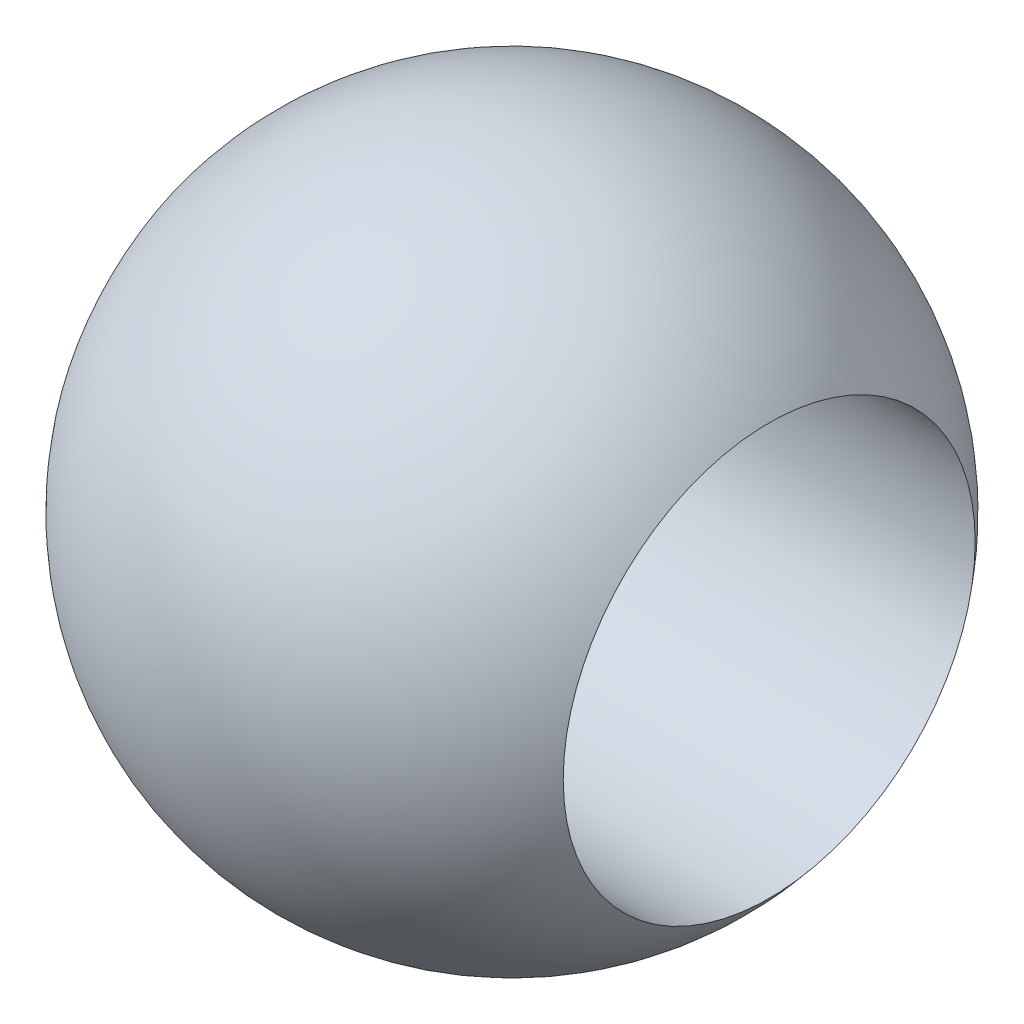
ISO-10303-21;
HEADER;
FILE_DESCRIPTION(('STEP AP214'),'2;1');
FILE_NAME('part.step','',(''),(''),'','','');
FILE_SCHEMA(('AUTOMOTIVE_DESIGN { 1 0 10303 214 1 1 1 1 }'));
ENDSEC;
DATA;
#1=APPLICATION_CONTEXT('core data for automotive mechanical design processes');
#2=APPLICATION_PROTOCOL_DEFINITION('international standard','automotive_design',2000,#1);
#3=PRODUCT_CONTEXT('',#1,'mechanical');
#4=PRODUCT('Part','Part','',(#3));
#5=PRODUCT_RELATED_PRODUCT_CATEGORY('part','',(#4));
#6=PRODUCT_DEFINITION_FORMATION('','',#4);
#7=PRODUCT_DEFINITION_CONTEXT('part definition',#1,'design');
#8=PRODUCT_DEFINITION('design','',#6,#7);
#9=PRODUCT_DEFINITION_SHAPE('','',#8);
#10=(LENGTH_UNIT() NAMED_UNIT(*) SI_UNIT(.MILLI.,.METRE.));
#11=(NAMED_UNIT(*) PLANE_ANGLE_UNIT() SI_UNIT($,.RADIAN.));
#12=(NAMED_UNIT(*) SI_UNIT($,.STERADIAN.) SOLID_ANGLE_UNIT());
#13=UNCERTAINTY_MEASURE_WITH_UNIT(LENGTH_MEASURE(1.E-05),#10,'distance_accuracy_value','');
#14=(GEOMETRIC_REPRESENTATION_CONTEXT(3) GLOBAL_UNCERTAINTY_ASSIGNED_CONTEXT((#13)) GLOBAL_UNIT_ASSIGNED_CONTEXT((#10,
#11,#12)) REPRESENTATION_CONTEXT('',''));
#15=CARTESIAN_POINT('',(0.,0.,0.));
#16=DIRECTION('',(0.,0.,1.));
#17=DIRECTION('',(1.,0.,0.));
#18=AXIS2_PLACEMENT_3D('',#15,#16,#17);
#19=CARTESIAN_POINT('',(0.,0.,0.));
#20=DIRECTION('',(1.,0.,0.));
#21=DIRECTION('',(0.,1.,0.));
#22=AXIS2_PLACEMENT_3D('',#19,#20,#21);
#23=SPHERICAL_SURFACE('',#22,8.128);
#24=CARTESIAN_POINT('',(-6.34491796637277,0.,0.));
#25=DIRECTION('',(1.,0.,0.));
#26=DIRECTION('',(0.,0.,-1.));
#27=AXIS2_PLACEMENT_3D('',#24,#25,#26);
#28=CIRCLE('',#27,5.08);
#29=CARTESIAN_POINT('',(-6.34491796637277,0.,-5.08));
#30=VERTEX_POINT('',#29);
#31=EDGE_CURVE('E10',#30,#30,#28,.T.);
#32=ORIENTED_EDGE('',*,*,#31,.T.);
#33=EDGE_LOOP('',(#32));
#34=FACE_BOUND('',#33,.T.);
#35=CARTESIAN_POINT('',(6.34491796637277,0.,0.));
#36=DIRECTION('',(1.,0.,0.));
#37=DIRECTION('',(0.,0.,-1.));
#38=AXIS2_PLACEMENT_3D('',#35,#36,#37);
#39=CIRCLE('',#38,5.08);
#40=CARTESIAN_POINT('',(6.34491796637277,0.,-5.08));
#41=VERTEX_POINT('',#40);
#42=EDGE_CURVE('E36',#41,#41,#39,.T.);
#43=ORIENTED_EDGE('',*,*,#42,.F.);
#44=EDGE_LOOP('',(#43));
#45=FACE_BOUND('',#44,.T.);
#46=ADVANCED_FACE('F30',(#34,#45),#23,.T.);
#47=CARTESIAN_POINT('',(11.3858972489895,0.,0.));
#48=DIRECTION('',(1.,0.,0.));
#49=DIRECTION('',(0.,0.,-1.));
#50=AXIS2_PLACEMENT_3D('',#47,#48,#49);
#51=CYLINDRICAL_SURFACE('',#50,5.08);
#52=ORIENTED_EDGE('',*,*,#42,.T.);
#53=EDGE_LOOP('',(#52));
#54=FACE_BOUND('',#53,.T.);
#55=ORIENTED_EDGE('',*,*,#31,.F.);
#56=EDGE_LOOP('',(#55));
#57=FACE_BOUND('',#56,.T.);
#58=ADVANCED_FACE('F42',(#54,#57),#51,.F.);
#59=CLOSED_SHELL('',(#46,#58));
#60=MANIFOLD_SOLID_BREP('B2',#59);
#61=ADVANCED_BREP_SHAPE_REPRESENTATION('',(#18,#60),#14);
#62=SHAPE_DEFINITION_REPRESENTATION(#9,#61);
ENDSEC;
END-ISO-10303-21;
